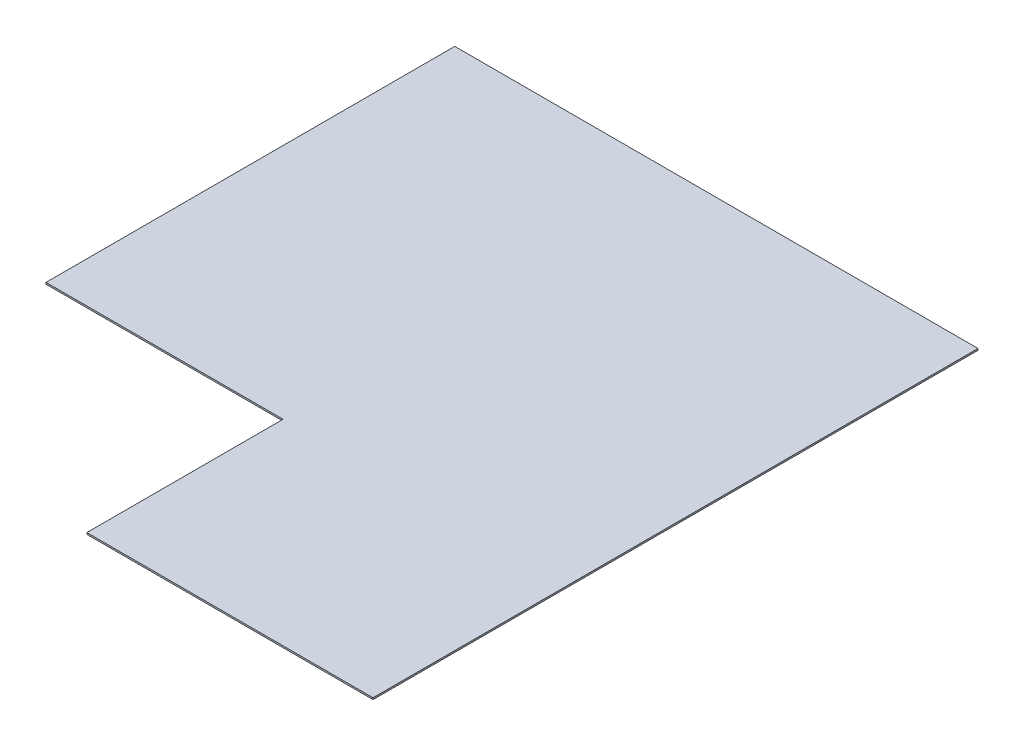
ISO-10303-21;
HEADER;
FILE_DESCRIPTION(('STEP AP214'),'2;1');
FILE_NAME('part.step','',(''),(''),'','','');
FILE_SCHEMA(('AUTOMOTIVE_DESIGN { 1 0 10303 214 1 1 1 1 }'));
ENDSEC;
DATA;
#1=APPLICATION_CONTEXT('core data for automotive mechanical design processes');
#2=APPLICATION_PROTOCOL_DEFINITION('international standard','automotive_design',2000,#1);
#3=PRODUCT_CONTEXT('',#1,'mechanical');
#4=PRODUCT('Part','Part','',(#3));
#5=PRODUCT_RELATED_PRODUCT_CATEGORY('part','',(#4));
#6=PRODUCT_DEFINITION_FORMATION('','',#4);
#7=PRODUCT_DEFINITION_CONTEXT('part definition',#1,'design');
#8=PRODUCT_DEFINITION('design','',#6,#7);
#9=PRODUCT_DEFINITION_SHAPE('','',#8);
#10=(LENGTH_UNIT() NAMED_UNIT(*) SI_UNIT(.MILLI.,.METRE.));
#11=(NAMED_UNIT(*) PLANE_ANGLE_UNIT() SI_UNIT($,.RADIAN.));
#12=(NAMED_UNIT(*) SI_UNIT($,.STERADIAN.) SOLID_ANGLE_UNIT());
#13=UNCERTAINTY_MEASURE_WITH_UNIT(LENGTH_MEASURE(1.E-05),#10,'distance_accuracy_value','');
#14=(GEOMETRIC_REPRESENTATION_CONTEXT(3) GLOBAL_UNCERTAINTY_ASSIGNED_CONTEXT((#13)) GLOBAL_UNIT_ASSIGNED_CONTEXT((#10,
#11,#12)) REPRESENTATION_CONTEXT('',''));
#15=CARTESIAN_POINT('',(0.,0.,0.));
#16=DIRECTION('',(0.,0.,1.));
#17=DIRECTION('',(1.,0.,0.));
#18=AXIS2_PLACEMENT_3D('',#15,#16,#17);
#19=CARTESIAN_POINT('',(0.,3.175,1174.75));
#20=DIRECTION('',(-1.,0.,0.));
#21=DIRECTION('',(0.,0.,1.));
#22=AXIS2_PLACEMENT_3D('',#19,#20,#21);
#23=PLANE('',#22);
#24=DIRECTION('',(0.,0.,-1.));
#25=VECTOR('',#24,1.);
#26=CARTESIAN_POINT('',(0.,0.,1174.75));
#27=LINE('',#26,#25);
#28=CARTESIAN_POINT('',(0.,0.,1174.75));
#29=VERTEX_POINT('',#28);
#30=CARTESIAN_POINT('',(0.,0.,0.));
#31=VERTEX_POINT('',#30);
#32=EDGE_CURVE('E119',#29,#31,#27,.T.);
#33=ORIENTED_EDGE('',*,*,#32,.T.);
#34=DIRECTION('',(0.,-1.,0.));
#35=VECTOR('',#34,1.);
#36=CARTESIAN_POINT('',(0.,3.175,0.));
#37=LINE('',#36,#35);
#38=CARTESIAN_POINT('',(0.,3.175,0.));
#39=VERTEX_POINT('',#38);
#40=EDGE_CURVE('E11',#39,#31,#37,.T.);
#41=ORIENTED_EDGE('',*,*,#40,.F.);
#42=DIRECTION('',(0.,0.,-1.));
#43=VECTOR('',#42,1.);
#44=CARTESIAN_POINT('',(0.,3.175,1174.75));
#45=LINE('',#44,#43);
#46=CARTESIAN_POINT('',(0.,3.175,1174.75));
#47=VERTEX_POINT('',#46);
#48=EDGE_CURVE('E129',#47,#39,#45,.T.);
#49=ORIENTED_EDGE('',*,*,#48,.F.);
#50=DIRECTION('',(0.,-1.,0.));
#51=VECTOR('',#50,1.);
#52=CARTESIAN_POINT('',(0.,3.175,1174.75));
#53=LINE('',#52,#51);
#54=EDGE_CURVE('E115',#47,#29,#53,.T.);
#55=ORIENTED_EDGE('',*,*,#54,.T.);
#56=EDGE_LOOP('',(#33,#41,#49,#55));
#57=FACE_BOUND('',#56,.T.);
#58=ADVANCED_FACE('F35',(#57),#23,.F.);
#59=CARTESIAN_POINT('',(0.,3.175,0.));
#60=DIRECTION('',(0.,0.,1.));
#61=DIRECTION('',(1.,0.,0.));
#62=AXIS2_PLACEMENT_3D('',#59,#60,#61);
#63=PLANE('',#62);
#64=DIRECTION('',(-1.,0.,0.));
#65=VECTOR('',#64,1.);
#66=CARTESIAN_POINT('',(0.,0.,0.));
#67=LINE('',#66,#65);
#68=CARTESIAN_POINT('',(-1016.,0.,1.24424114793371E-13));
#69=VERTEX_POINT('',#68);
#70=EDGE_CURVE('E122',#31,#69,#67,.T.);
#71=ORIENTED_EDGE('',*,*,#70,.T.);
#72=DIRECTION('',(0.,-1.,0.));
#73=VECTOR('',#72,1.);
#74=CARTESIAN_POINT('',(-1016.,3.175,1.24424114793371E-13));
#75=LINE('',#74,#73);
#76=CARTESIAN_POINT('',(-1016.,3.175,1.24424114793371E-13));
#77=VERTEX_POINT('',#76);
#78=EDGE_CURVE('E43',#77,#69,#75,.T.);
#79=ORIENTED_EDGE('',*,*,#78,.F.);
#80=DIRECTION('',(-1.,0.,0.));
#81=VECTOR('',#80,1.);
#82=CARTESIAN_POINT('',(0.,3.175,0.));
#83=LINE('',#82,#81);
#84=EDGE_CURVE('E88',#39,#77,#83,.T.);
#85=ORIENTED_EDGE('',*,*,#84,.F.);
#86=ORIENTED_EDGE('',*,*,#40,.T.);
#87=EDGE_LOOP('',(#71,#79,#85,#86));
#88=FACE_BOUND('',#87,.T.);
#89=ADVANCED_FACE('F153',(#88),#63,.F.);
#90=CARTESIAN_POINT('',(-1016.,3.175,1.24424114793371E-13));
#91=DIRECTION('',(1.,0.,0.));
#92=DIRECTION('',(0.,0.,-1.));
#93=AXIS2_PLACEMENT_3D('',#90,#91,#92);
#94=PLANE('',#93);
#95=DIRECTION('',(0.,0.,1.));
#96=VECTOR('',#95,1.);
#97=CARTESIAN_POINT('',(-1016.,0.,1.24424114793371E-13));
#98=LINE('',#97,#96);
#99=CARTESIAN_POINT('',(-1016.,0.,793.75));
#100=VERTEX_POINT('',#99);
#101=EDGE_CURVE('E124',#69,#100,#98,.T.);
#102=ORIENTED_EDGE('',*,*,#101,.T.);
#103=DIRECTION('',(0.,-1.,0.));
#104=VECTOR('',#103,1.);
#105=CARTESIAN_POINT('',(-1016.,3.175,793.75));
#106=LINE('',#105,#104);
#107=CARTESIAN_POINT('',(-1016.,3.175,793.75));
#108=VERTEX_POINT('',#107);
#109=EDGE_CURVE('E110',#108,#100,#106,.T.);
#110=ORIENTED_EDGE('',*,*,#109,.F.);
#111=DIRECTION('',(0.,0.,1.));
#112=VECTOR('',#111,1.);
#113=CARTESIAN_POINT('',(-1016.,3.175,1.24424114793371E-13));
#114=LINE('',#113,#112);
#115=EDGE_CURVE('E101',#77,#108,#114,.T.);
#116=ORIENTED_EDGE('',*,*,#115,.F.);
#117=ORIENTED_EDGE('',*,*,#78,.T.);
#118=EDGE_LOOP('',(#102,#110,#116,#117));
#119=FACE_BOUND('',#118,.T.);
#120=ADVANCED_FACE('F135',(#119),#94,.F.);
#121=CARTESIAN_POINT('',(-1016.,3.175,793.75));
#122=DIRECTION('',(0.,0.,-1.));
#123=DIRECTION('',(-1.,0.,0.));
#124=AXIS2_PLACEMENT_3D('',#121,#122,#123);
#125=PLANE('',#124);
#126=DIRECTION('',(1.,0.,0.));
#127=VECTOR('',#126,1.);
#128=CARTESIAN_POINT('',(-1016.,0.,793.75));
#129=LINE('',#128,#127);
#130=CARTESIAN_POINT('',(-555.625,0.,793.75));
#131=VERTEX_POINT('',#130);
#132=EDGE_CURVE('E109',#100,#131,#129,.T.);
#133=ORIENTED_EDGE('',*,*,#132,.T.);
#134=DIRECTION('',(0.,-1.,0.));
#135=VECTOR('',#134,1.);
#136=CARTESIAN_POINT('',(-555.625,3.175,793.75));
#137=LINE('',#136,#135);
#138=CARTESIAN_POINT('',(-555.625,3.175,793.75));
#139=VERTEX_POINT('',#138);
#140=EDGE_CURVE('E106',#139,#131,#137,.T.);
#141=ORIENTED_EDGE('',*,*,#140,.F.);
#142=DIRECTION('',(1.,0.,0.));
#143=VECTOR('',#142,1.);
#144=CARTESIAN_POINT('',(-1016.,3.175,793.75));
#145=LINE('',#144,#143);
#146=EDGE_CURVE('E95',#108,#139,#145,.T.);
#147=ORIENTED_EDGE('',*,*,#146,.F.);
#148=ORIENTED_EDGE('',*,*,#109,.T.);
#149=EDGE_LOOP('',(#133,#141,#147,#148));
#150=FACE_BOUND('',#149,.T.);
#151=ADVANCED_FACE('F107',(#150),#125,.F.);
#152=CARTESIAN_POINT('',(-555.625,3.175,793.75));
#153=DIRECTION('',(1.,0.,0.));
#154=DIRECTION('',(0.,0.,-1.));
#155=AXIS2_PLACEMENT_3D('',#152,#153,#154);
#156=PLANE('',#155);
#157=DIRECTION('',(0.,0.,1.));
#158=VECTOR('',#157,1.);
#159=CARTESIAN_POINT('',(-555.625,0.,793.75));
#160=LINE('',#159,#158);
#161=CARTESIAN_POINT('',(-555.624999999999,0.,1174.75));
#162=VERTEX_POINT('',#161);
#163=EDGE_CURVE('E74',#131,#162,#160,.T.);
#164=ORIENTED_EDGE('',*,*,#163,.T.);
#165=DIRECTION('',(0.,-1.,0.));
#166=VECTOR('',#165,1.);
#167=CARTESIAN_POINT('',(-555.624999999999,3.175,1174.75));
#168=LINE('',#167,#166);
#169=CARTESIAN_POINT('',(-555.624999999999,3.175,1174.75));
#170=VERTEX_POINT('',#169);
#171=EDGE_CURVE('E111',#170,#162,#168,.T.);
#172=ORIENTED_EDGE('',*,*,#171,.F.);
#173=DIRECTION('',(0.,0.,1.));
#174=VECTOR('',#173,1.);
#175=CARTESIAN_POINT('',(-555.625,3.175,793.75));
#176=LINE('',#175,#174);
#177=EDGE_CURVE('E99',#139,#170,#176,.T.);
#178=ORIENTED_EDGE('',*,*,#177,.F.);
#179=ORIENTED_EDGE('',*,*,#140,.T.);
#180=EDGE_LOOP('',(#164,#172,#178,#179));
#181=FACE_BOUND('',#180,.T.);
#182=ADVANCED_FACE('F113',(#181),#156,.F.);
#183=CARTESIAN_POINT('',(-555.624999999999,3.175,1174.75));
#184=DIRECTION('',(0.,0.,-1.));
#185=DIRECTION('',(-1.,0.,0.));
#186=AXIS2_PLACEMENT_3D('',#183,#184,#185);
#187=PLANE('',#186);
#188=DIRECTION('',(1.,0.,0.));
#189=VECTOR('',#188,1.);
#190=CARTESIAN_POINT('',(-555.624999999999,0.,1174.75));
#191=LINE('',#190,#189);
#192=EDGE_CURVE('E80',#162,#29,#191,.T.);
#193=ORIENTED_EDGE('',*,*,#192,.T.);
#194=ORIENTED_EDGE('',*,*,#54,.F.);
#195=DIRECTION('',(1.,0.,0.));
#196=VECTOR('',#195,1.);
#197=CARTESIAN_POINT('',(-555.624999999999,3.175,1174.75));
#198=LINE('',#197,#196);
#199=EDGE_CURVE('E51',#170,#47,#198,.T.);
#200=ORIENTED_EDGE('',*,*,#199,.F.);
#201=ORIENTED_EDGE('',*,*,#171,.T.);
#202=EDGE_LOOP('',(#193,#194,#200,#201));
#203=FACE_BOUND('',#202,.T.);
#204=ADVANCED_FACE('F142',(#203),#187,.F.);
#205=CARTESIAN_POINT('',(0.,3.175,0.));
#206=DIRECTION('',(0.,1.,0.));
#207=DIRECTION('',(0.,0.,1.));
#208=AXIS2_PLACEMENT_3D('',#205,#206,#207);
#209=PLANE('',#208);
#210=ORIENTED_EDGE('',*,*,#48,.T.);
#211=ORIENTED_EDGE('',*,*,#84,.T.);
#212=ORIENTED_EDGE('',*,*,#115,.T.);
#213=ORIENTED_EDGE('',*,*,#146,.T.);
#214=ORIENTED_EDGE('',*,*,#177,.T.);
#215=ORIENTED_EDGE('',*,*,#199,.T.);
#216=EDGE_LOOP('',(#210,#211,#212,#213,#214,#215));
#217=FACE_BOUND('',#216,.T.);
#218=ADVANCED_FACE('F97',(#217),#209,.T.);
#219=CARTESIAN_POINT('',(0.,0.,0.));
#220=DIRECTION('',(0.,1.,0.));
#221=DIRECTION('',(0.,0.,1.));
#222=AXIS2_PLACEMENT_3D('',#219,#220,#221);
#223=PLANE('',#222);
#224=ORIENTED_EDGE('',*,*,#32,.F.);
#225=ORIENTED_EDGE('',*,*,#192,.F.);
#226=ORIENTED_EDGE('',*,*,#163,.F.);
#227=ORIENTED_EDGE('',*,*,#132,.F.);
#228=ORIENTED_EDGE('',*,*,#101,.F.);
#229=ORIENTED_EDGE('',*,*,#70,.F.);
#230=EDGE_LOOP('',(#224,#225,#226,#227,#228,#229));
#231=FACE_BOUND('',#230,.T.);
#232=ADVANCED_FACE('F138',(#231),#223,.F.);
#233=CLOSED_SHELL('',(#58,#89,#120,#151,#182,#204,#218,#232));
#234=MANIFOLD_SOLID_BREP('B2',#233);
#235=ADVANCED_BREP_SHAPE_REPRESENTATION('',(#18,#234),#14);
#236=SHAPE_DEFINITION_REPRESENTATION(#9,#235);
ENDSEC;
END-ISO-10303-21;
